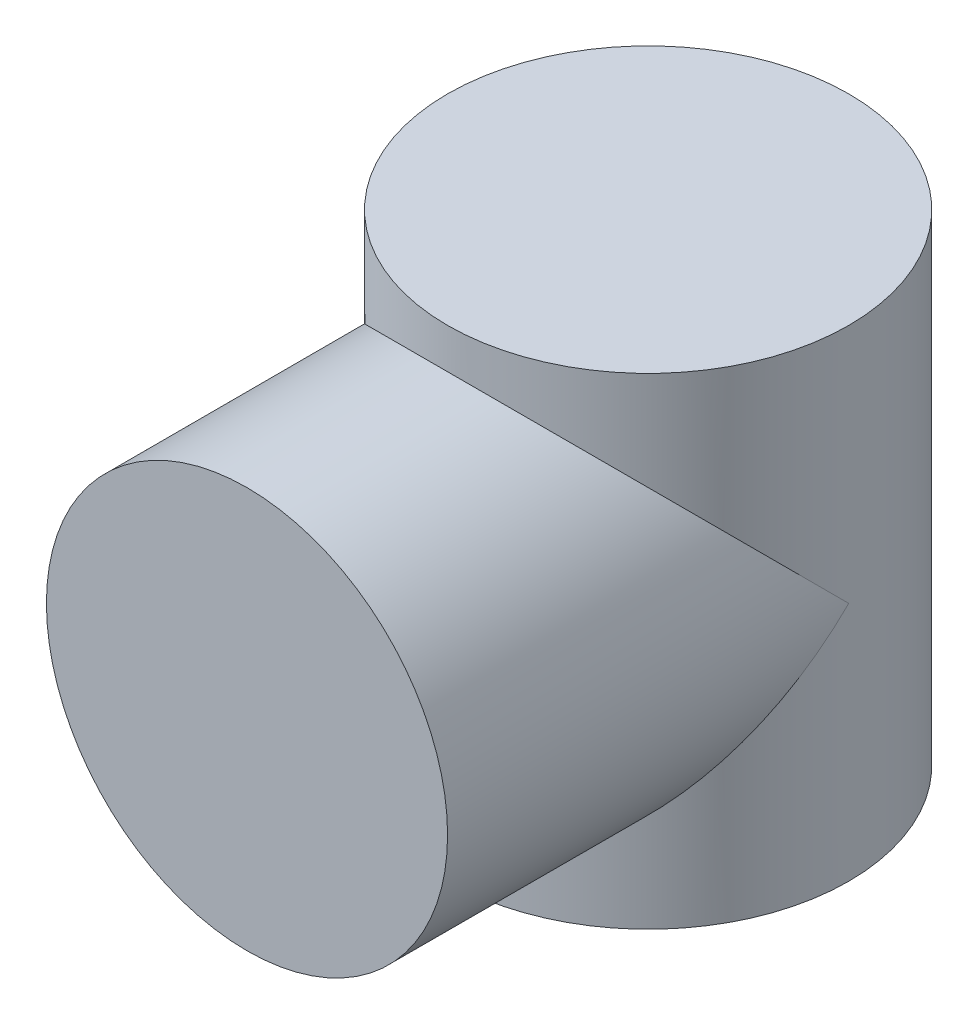
ISO-10303-21;
HEADER;
FILE_DESCRIPTION(('STEP AP214'),'2;1');
FILE_NAME('part.step','',(''),(''),'','','');
FILE_SCHEMA(('AUTOMOTIVE_DESIGN { 1 0 10303 214 1 1 1 1 }'));
ENDSEC;
DATA;
#1=APPLICATION_CONTEXT('core data for automotive mechanical design processes');
#2=APPLICATION_PROTOCOL_DEFINITION('international standard','automotive_design',2000,#1);
#3=PRODUCT_CONTEXT('',#1,'mechanical');
#4=PRODUCT('Part','Part','',(#3));
#5=PRODUCT_RELATED_PRODUCT_CATEGORY('part','',(#4));
#6=PRODUCT_DEFINITION_FORMATION('','',#4);
#7=PRODUCT_DEFINITION_CONTEXT('part definition',#1,'design');
#8=PRODUCT_DEFINITION('design','',#6,#7);
#9=PRODUCT_DEFINITION_SHAPE('','',#8);
#10=(LENGTH_UNIT() NAMED_UNIT(*) SI_UNIT(.MILLI.,.METRE.));
#11=(NAMED_UNIT(*) PLANE_ANGLE_UNIT() SI_UNIT($,.RADIAN.));
#12=(NAMED_UNIT(*) SI_UNIT($,.STERADIAN.) SOLID_ANGLE_UNIT());
#13=UNCERTAINTY_MEASURE_WITH_UNIT(LENGTH_MEASURE(1.E-05),#10,'distance_accuracy_value','');
#14=(GEOMETRIC_REPRESENTATION_CONTEXT(3) GLOBAL_UNCERTAINTY_ASSIGNED_CONTEXT((#13)) GLOBAL_UNIT_ASSIGNED_CONTEXT((#10,
#11,#12)) REPRESENTATION_CONTEXT('',''));
#15=CARTESIAN_POINT('',(0.,0.,0.));
#16=DIRECTION('',(0.,0.,1.));
#17=DIRECTION('',(1.,0.,0.));
#18=AXIS2_PLACEMENT_3D('',#15,#16,#17);
#19=CARTESIAN_POINT('',(0.,60.,0.));
#20=DIRECTION('',(0.,-1.,0.));
#21=DIRECTION('',(0.,0.,-1.));
#22=AXIS2_PLACEMENT_3D('',#19,#20,#21);
#23=CYLINDRICAL_SURFACE('',#22,50.);
#24=CARTESIAN_POINT('',(0.,-60.,0.));
#25=DIRECTION('',(0.,1.,0.));
#26=DIRECTION('',(0.,0.,1.));
#27=AXIS2_PLACEMENT_3D('',#24,#25,#26);
#28=CIRCLE('',#27,50.);
#29=CARTESIAN_POINT('',(0.,-60.,50.));
#30=VERTEX_POINT('',#29);
#31=EDGE_CURVE('E51',#30,#30,#28,.T.);
#32=ORIENTED_EDGE('',*,*,#31,.T.);
#33=EDGE_LOOP('',(#32));
#34=FACE_BOUND('',#33,.T.);
#35=CARTESIAN_POINT('',(0.,60.,0.));
#36=DIRECTION('',(0.,1.,0.));
#37=DIRECTION('',(0.,0.,1.));
#38=AXIS2_PLACEMENT_3D('',#35,#36,#37);
#39=CIRCLE('',#38,50.);
#40=CARTESIAN_POINT('',(0.,60.,50.));
#41=VERTEX_POINT('',#40);
#42=EDGE_CURVE('E49',#41,#41,#39,.T.);
#43=ORIENTED_EDGE('',*,*,#42,.F.);
#44=EDGE_LOOP('',(#43));
#45=FACE_BOUND('',#44,.T.);
#46=CARTESIAN_POINT('',(0.,0.,0.));
#47=DIRECTION('',(0.,-0.707106781186547,-0.707106781186547));
#48=DIRECTION('',(0.,-0.707106781186547,0.707106781186547));
#49=AXIS2_PLACEMENT_3D('',#46,#47,#48);
#50=ELLIPSE('',#49,70.7106781186548,50.);
#51=CARTESIAN_POINT('',(-50.,0.,0.));
#52=VERTEX_POINT('',#51);
#53=CARTESIAN_POINT('',(50.,0.,0.));
#54=VERTEX_POINT('',#53);
#55=EDGE_CURVE('E11',#52,#54,#50,.F.);
#56=ORIENTED_EDGE('',*,*,#55,.F.);
#57=CARTESIAN_POINT('',(0.,0.,0.));
#58=DIRECTION('',(0.,-0.707106781186547,0.707106781186547));
#59=DIRECTION('',(0.,-0.707106781186547,-0.707106781186547));
#60=AXIS2_PLACEMENT_3D('',#57,#58,#59);
#61=ELLIPSE('',#60,70.7106781186548,50.);
#62=EDGE_CURVE('E41',#54,#52,#61,.T.);
#63=ORIENTED_EDGE('',*,*,#62,.F.);
#64=EDGE_LOOP('',(#56,#63));
#65=FACE_BOUND('',#64,.T.);
#66=ADVANCED_FACE('F34',(#34,#45,#65),#23,.T.);
#67=CARTESIAN_POINT('',(0.,60.,0.));
#68=DIRECTION('',(0.,1.,0.));
#69=DIRECTION('',(0.,0.,1.));
#70=AXIS2_PLACEMENT_3D('',#67,#68,#69);
#71=PLANE('',#70);
#72=ORIENTED_EDGE('',*,*,#42,.T.);
#73=EDGE_LOOP('',(#72));
#74=FACE_BOUND('',#73,.T.);
#75=ADVANCED_FACE('F70',(#74),#71,.T.);
#76=CARTESIAN_POINT('',(0.,-60.,0.));
#77=DIRECTION('',(0.,1.,0.));
#78=DIRECTION('',(0.,0.,1.));
#79=AXIS2_PLACEMENT_3D('',#76,#77,#78);
#80=PLANE('',#79);
#81=ORIENTED_EDGE('',*,*,#31,.F.);
#82=EDGE_LOOP('',(#81));
#83=FACE_BOUND('',#82,.T.);
#84=ADVANCED_FACE('F63',(#83),#80,.F.);
#85=CARTESIAN_POINT('',(0.,0.,100.));
#86=DIRECTION('',(0.,0.,-1.));
#87=DIRECTION('',(-1.,0.,0.));
#88=AXIS2_PLACEMENT_3D('',#85,#86,#87);
#89=CYLINDRICAL_SURFACE('',#88,50.);
#90=CARTESIAN_POINT('',(0.,0.,100.));
#91=DIRECTION('',(0.,0.,1.));
#92=DIRECTION('',(1.,0.,0.));
#93=AXIS2_PLACEMENT_3D('',#90,#91,#92);
#94=CIRCLE('',#93,50.);
#95=CARTESIAN_POINT('',(50.,0.,100.));
#96=VERTEX_POINT('',#95);
#97=EDGE_CURVE('E55',#96,#96,#94,.T.);
#98=ORIENTED_EDGE('',*,*,#97,.F.);
#99=EDGE_LOOP('',(#98));
#100=FACE_BOUND('',#99,.T.);
#101=ORIENTED_EDGE('',*,*,#62,.T.);
#102=ORIENTED_EDGE('',*,*,#55,.T.);
#103=EDGE_LOOP('',(#101,#102));
#104=FACE_BOUND('',#103,.T.);
#105=ADVANCED_FACE('F48',(#100,#104),#89,.T.);
#106=CARTESIAN_POINT('',(0.,0.,100.));
#107=DIRECTION('',(0.,0.,1.));
#108=DIRECTION('',(1.,0.,0.));
#109=AXIS2_PLACEMENT_3D('',#106,#107,#108);
#110=PLANE('',#109);
#111=ORIENTED_EDGE('',*,*,#97,.T.);
#112=EDGE_LOOP('',(#111));
#113=FACE_BOUND('',#112,.T.);
#114=ADVANCED_FACE('F60',(#113),#110,.T.);
#115=CLOSED_SHELL('',(#66,#75,#84,#105,#114));
#116=MANIFOLD_SOLID_BREP('B2',#115);
#117=ADVANCED_BREP_SHAPE_REPRESENTATION('',(#18,#116),#14);
#118=SHAPE_DEFINITION_REPRESENTATION(#9,#117);
ENDSEC;
END-ISO-10303-21;
